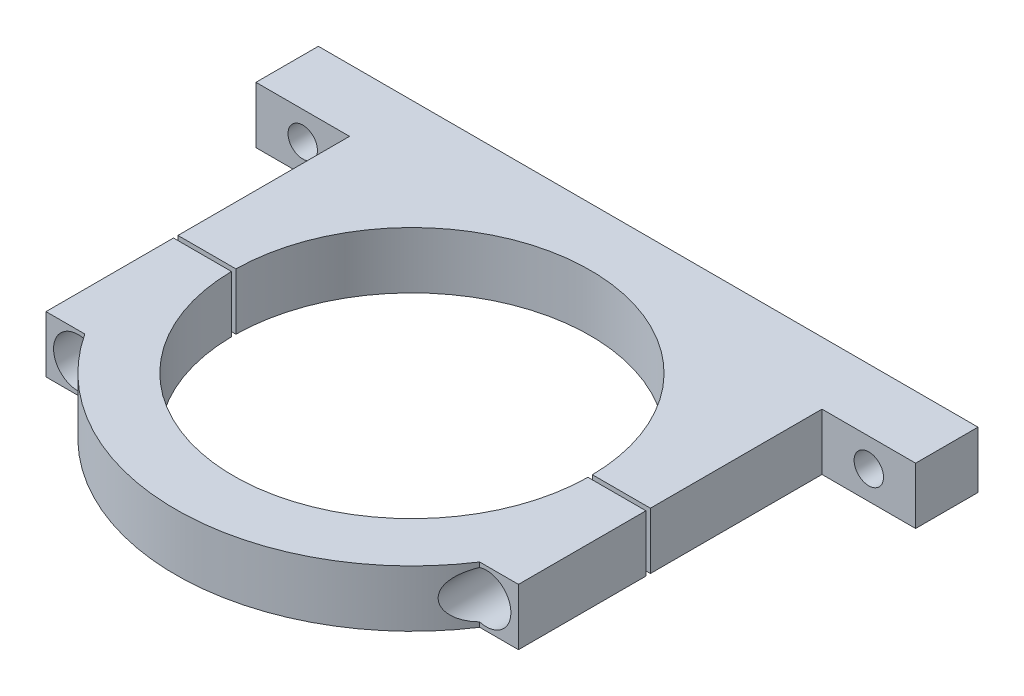
ISO-10303-21;
HEADER;
FILE_DESCRIPTION(('STEP AP214'),'2;1');
FILE_NAME('part.step','',(''),(''),'','','');
FILE_SCHEMA(('AUTOMOTIVE_DESIGN { 1 0 10303 214 1 1 1 1 }'));
ENDSEC;
DATA;
#1=APPLICATION_CONTEXT('core data for automotive mechanical design processes');
#2=APPLICATION_PROTOCOL_DEFINITION('international standard','automotive_design',2000,#1);
#3=PRODUCT_CONTEXT('',#1,'mechanical');
#4=PRODUCT('Part','Part','',(#3));
#5=PRODUCT_RELATED_PRODUCT_CATEGORY('part','',(#4));
#6=PRODUCT_DEFINITION_FORMATION('','',#4);
#7=PRODUCT_DEFINITION_CONTEXT('part definition',#1,'design');
#8=PRODUCT_DEFINITION('design','',#6,#7);
#9=PRODUCT_DEFINITION_SHAPE('','',#8);
#10=(LENGTH_UNIT() NAMED_UNIT(*) SI_UNIT(.MILLI.,.METRE.));
#11=(NAMED_UNIT(*) PLANE_ANGLE_UNIT() SI_UNIT($,.RADIAN.));
#12=(NAMED_UNIT(*) SI_UNIT($,.STERADIAN.) SOLID_ANGLE_UNIT());
#13=UNCERTAINTY_MEASURE_WITH_UNIT(LENGTH_MEASURE(1.E-05),#10,'distance_accuracy_value','');
#14=(GEOMETRIC_REPRESENTATION_CONTEXT(3) GLOBAL_UNCERTAINTY_ASSIGNED_CONTEXT((#13)) GLOBAL_UNIT_ASSIGNED_CONTEXT((#10,
#11,#12)) REPRESENTATION_CONTEXT('',''));
#15=CARTESIAN_POINT('',(0.,0.,0.));
#16=DIRECTION('',(0.,0.,1.));
#17=DIRECTION('',(1.,0.,0.));
#18=AXIS2_PLACEMENT_3D('',#15,#16,#17);
#19=CARTESIAN_POINT('',(0.,12.7,0.));
#20=DIRECTION('',(0.,1.,0.));
#21=DIRECTION('',(0.,0.,1.));
#22=AXIS2_PLACEMENT_3D('',#19,#20,#21);
#23=PLANE('',#22);
#24=DIRECTION('',(-1.,0.,0.));
#25=VECTOR('',#24,1.);
#26=CARTESIAN_POINT('',(0.,12.7,-0.499999999999999));
#27=LINE('',#26,#25);
#28=CARTESIAN_POINT('',(53.,12.7,-0.500000000000006));
#29=VERTEX_POINT('',#28);
#30=CARTESIAN_POINT('',(39.9968748779201,12.7,-0.500000000000004));
#31=VERTEX_POINT('',#30);
#32=EDGE_CURVE('E82',#29,#31,#27,.T.);
#33=ORIENTED_EDGE('',*,*,#32,.F.);
#34=DIRECTION('',(0.,0.,-1.));
#35=VECTOR('',#34,1.);
#36=CARTESIAN_POINT('',(53.,12.7,0.));
#37=LINE('',#36,#35);
#38=CARTESIAN_POINT('',(53.,12.7,-39.));
#39=VERTEX_POINT('',#38);
#40=EDGE_CURVE('E156',#29,#39,#37,.T.);
#41=ORIENTED_EDGE('',*,*,#40,.T.);
#42=DIRECTION('',(1.,0.,0.));
#43=VECTOR('',#42,1.);
#44=CARTESIAN_POINT('',(74.,12.7,-39.));
#45=LINE('',#44,#43);
#46=CARTESIAN_POINT('',(74.,12.7,-39.));
#47=VERTEX_POINT('',#46);
#48=EDGE_CURVE('E158',#39,#47,#45,.T.);
#49=ORIENTED_EDGE('',*,*,#48,.T.);
#50=DIRECTION('',(0.,0.,-1.));
#51=VECTOR('',#50,1.);
#52=CARTESIAN_POINT('',(74.,12.7,-53.));
#53=LINE('',#52,#51);
#54=CARTESIAN_POINT('',(74.,12.7,-53.));
#55=VERTEX_POINT('',#54);
#56=EDGE_CURVE('E187',#47,#55,#53,.T.);
#57=ORIENTED_EDGE('',*,*,#56,.T.);
#58=DIRECTION('',(-1.,0.,0.));
#59=VECTOR('',#58,1.);
#60=CARTESIAN_POINT('',(-74.,12.7,-53.));
#61=LINE('',#60,#59);
#62=CARTESIAN_POINT('',(-74.,12.7,-53.));
#63=VERTEX_POINT('',#62);
#64=EDGE_CURVE('E189',#55,#63,#61,.T.);
#65=ORIENTED_EDGE('',*,*,#64,.T.);
#66=DIRECTION('',(0.,0.,1.));
#67=VECTOR('',#66,1.);
#68=CARTESIAN_POINT('',(-74.,12.7,-53.));
#69=LINE('',#68,#67);
#70=CARTESIAN_POINT('',(-74.,12.7,-39.));
#71=VERTEX_POINT('',#70);
#72=EDGE_CURVE('E191',#63,#71,#69,.T.);
#73=ORIENTED_EDGE('',*,*,#72,.T.);
#74=DIRECTION('',(1.,0.,0.));
#75=VECTOR('',#74,1.);
#76=CARTESIAN_POINT('',(-74.,12.7,-39.));
#77=LINE('',#76,#75);
#78=CARTESIAN_POINT('',(-53.,12.7,-39.));
#79=VERTEX_POINT('',#78);
#80=EDGE_CURVE('E161',#71,#79,#77,.T.);
#81=ORIENTED_EDGE('',*,*,#80,.T.);
#82=DIRECTION('',(0.,0.,1.));
#83=VECTOR('',#82,1.);
#84=CARTESIAN_POINT('',(-53.,12.7,-39.));
#85=LINE('',#84,#83);
#86=CARTESIAN_POINT('',(-53.,12.7,-0.499999999999993));
#87=VERTEX_POINT('',#86);
#88=EDGE_CURVE('E141',#79,#87,#85,.T.);
#89=ORIENTED_EDGE('',*,*,#88,.T.);
#90=CARTESIAN_POINT('',(-39.9968748779201,12.7,-0.499999999999995));
#91=VERTEX_POINT('',#90);
#92=EDGE_CURVE('E129',#91,#87,#27,.T.);
#93=ORIENTED_EDGE('',*,*,#92,.F.);
#94=CARTESIAN_POINT('',(0.,12.7,0.));
#95=DIRECTION('',(0.,1.,0.));
#96=DIRECTION('',(0.,0.,1.));
#97=AXIS2_PLACEMENT_3D('',#94,#95,#96);
#98=CIRCLE('',#97,40.);
#99=EDGE_CURVE('E139',#31,#91,#98,.T.);
#100=ORIENTED_EDGE('',*,*,#99,.F.);
#101=EDGE_LOOP('',(#33,#41,#49,#57,#65,#73,#81,#89,#93,#100));
#102=FACE_BOUND('',#101,.T.);
#103=ADVANCED_FACE('F44',(#102),#23,.T.);
#104=CARTESIAN_POINT('',(0.,0.,0.));
#105=DIRECTION('',(0.,1.,0.));
#106=DIRECTION('',(0.,0.,1.));
#107=AXIS2_PLACEMENT_3D('',#104,#105,#106);
#108=PLANE('',#107);
#109=DIRECTION('',(0.,0.,-1.));
#110=VECTOR('',#109,1.);
#111=CARTESIAN_POINT('',(53.,0.,-39.));
#112=LINE('',#111,#110);
#113=CARTESIAN_POINT('',(53.,0.,-0.500000000000006));
#114=VERTEX_POINT('',#113);
#115=CARTESIAN_POINT('',(53.,0.,-39.));
#116=VERTEX_POINT('',#115);
#117=EDGE_CURVE('E151',#114,#116,#112,.T.);
#118=ORIENTED_EDGE('',*,*,#117,.F.);
#119=DIRECTION('',(-1.,0.,0.));
#120=VECTOR('',#119,1.);
#121=CARTESIAN_POINT('',(76.8528802581366,0.,-0.500000000000009));
#122=LINE('',#121,#120);
#123=CARTESIAN_POINT('',(39.9968748779201,0.,-0.500000000000004));
#124=VERTEX_POINT('',#123);
#125=EDGE_CURVE('E160',#114,#124,#122,.T.);
#126=ORIENTED_EDGE('',*,*,#125,.T.);
#127=CARTESIAN_POINT('',(0.,0.,0.));
#128=DIRECTION('',(0.,1.,0.));
#129=DIRECTION('',(0.,0.,1.));
#130=AXIS2_PLACEMENT_3D('',#127,#128,#129);
#131=CIRCLE('',#130,40.);
#132=CARTESIAN_POINT('',(-39.9968748779201,0.,-0.499999999999995));
#133=VERTEX_POINT('',#132);
#134=EDGE_CURVE('E48',#124,#133,#131,.T.);
#135=ORIENTED_EDGE('',*,*,#134,.T.);
#136=CARTESIAN_POINT('',(-53.,0.,-0.499999999999993));
#137=VERTEX_POINT('',#136);
#138=EDGE_CURVE('E124',#133,#137,#122,.T.);
#139=ORIENTED_EDGE('',*,*,#138,.T.);
#140=DIRECTION('',(0.,0.,1.));
#141=VECTOR('',#140,1.);
#142=CARTESIAN_POINT('',(-53.,0.,29.1));
#143=LINE('',#142,#141);
#144=CARTESIAN_POINT('',(-53.,0.,-39.));
#145=VERTEX_POINT('',#144);
#146=EDGE_CURVE('E153',#145,#137,#143,.T.);
#147=ORIENTED_EDGE('',*,*,#146,.F.);
#148=DIRECTION('',(1.,0.,0.));
#149=VECTOR('',#148,1.);
#150=CARTESIAN_POINT('',(-74.,0.,-39.));
#151=LINE('',#150,#149);
#152=CARTESIAN_POINT('',(-74.,0.,-39.));
#153=VERTEX_POINT('',#152);
#154=EDGE_CURVE('E201',#153,#145,#151,.T.);
#155=ORIENTED_EDGE('',*,*,#154,.F.);
#156=DIRECTION('',(0.,0.,1.));
#157=VECTOR('',#156,1.);
#158=CARTESIAN_POINT('',(-74.,0.,-53.));
#159=LINE('',#158,#157);
#160=CARTESIAN_POINT('',(-74.,0.,-53.));
#161=VERTEX_POINT('',#160);
#162=EDGE_CURVE('E198',#161,#153,#159,.T.);
#163=ORIENTED_EDGE('',*,*,#162,.F.);
#164=DIRECTION('',(-1.,0.,0.));
#165=VECTOR('',#164,1.);
#166=CARTESIAN_POINT('',(-74.,0.,-53.));
#167=LINE('',#166,#165);
#168=CARTESIAN_POINT('',(74.,0.,-53.));
#169=VERTEX_POINT('',#168);
#170=EDGE_CURVE('E182',#169,#161,#167,.T.);
#171=ORIENTED_EDGE('',*,*,#170,.F.);
#172=DIRECTION('',(0.,0.,-1.));
#173=VECTOR('',#172,1.);
#174=CARTESIAN_POINT('',(74.,0.,-53.));
#175=LINE('',#174,#173);
#176=CARTESIAN_POINT('',(74.,0.,-39.));
#177=VERTEX_POINT('',#176);
#178=EDGE_CURVE('E194',#177,#169,#175,.T.);
#179=ORIENTED_EDGE('',*,*,#178,.F.);
#180=DIRECTION('',(1.,0.,0.));
#181=VECTOR('',#180,1.);
#182=CARTESIAN_POINT('',(74.,0.,-39.));
#183=LINE('',#182,#181);
#184=EDGE_CURVE('E144',#116,#177,#183,.T.);
#185=ORIENTED_EDGE('',*,*,#184,.F.);
#186=EDGE_LOOP('',(#118,#126,#135,#139,#147,#155,#163,#171,#179,#185));
#187=FACE_BOUND('',#186,.T.);
#188=ADVANCED_FACE('F234',(#187),#108,.F.);
#189=CARTESIAN_POINT('',(53.,12.7,-39.));
#190=DIRECTION('',(-1.,0.,0.));
#191=DIRECTION('',(0.,0.,1.));
#192=AXIS2_PLACEMENT_3D('',#189,#190,#191);
#193=PLANE('',#192);
#194=ORIENTED_EDGE('',*,*,#40,.F.);
#195=DIRECTION('',(0.,-1.,0.));
#196=VECTOR('',#195,1.);
#197=CARTESIAN_POINT('',(53.,12.7,-0.500000000000007));
#198=LINE('',#197,#196);
#199=EDGE_CURVE('E122',#29,#114,#198,.T.);
#200=ORIENTED_EDGE('',*,*,#199,.T.);
#201=ORIENTED_EDGE('',*,*,#117,.T.);
#202=DIRECTION('',(0.,-1.,0.));
#203=VECTOR('',#202,1.);
#204=CARTESIAN_POINT('',(53.,12.7,-39.));
#205=LINE('',#204,#203);
#206=EDGE_CURVE('E146',#39,#116,#205,.T.);
#207=ORIENTED_EDGE('',*,*,#206,.F.);
#208=EDGE_LOOP('',(#194,#200,#201,#207));
#209=FACE_BOUND('',#208,.T.);
#210=ADVANCED_FACE('F238',(#209),#193,.F.);
#211=CARTESIAN_POINT('',(-53.,12.7,29.1));
#212=DIRECTION('',(1.,0.,0.));
#213=DIRECTION('',(0.,0.,-1.));
#214=AXIS2_PLACEMENT_3D('',#211,#212,#213);
#215=PLANE('',#214);
#216=ORIENTED_EDGE('',*,*,#146,.T.);
#217=DIRECTION('',(0.,1.,0.));
#218=VECTOR('',#217,1.);
#219=CARTESIAN_POINT('',(-53.,12.7,-0.49999999999999));
#220=LINE('',#219,#218);
#221=EDGE_CURVE('E63',#137,#87,#220,.T.);
#222=ORIENTED_EDGE('',*,*,#221,.T.);
#223=ORIENTED_EDGE('',*,*,#88,.F.);
#224=DIRECTION('',(0.,-1.,0.));
#225=VECTOR('',#224,1.);
#226=CARTESIAN_POINT('',(-53.,12.7,-39.));
#227=LINE('',#226,#225);
#228=EDGE_CURVE('E145',#79,#145,#227,.T.);
#229=ORIENTED_EDGE('',*,*,#228,.T.);
#230=EDGE_LOOP('',(#216,#222,#223,#229));
#231=FACE_BOUND('',#230,.T.);
#232=ADVANCED_FACE('F242',(#231),#215,.F.);
#233=CARTESIAN_POINT('',(0.,12.7,0.));
#234=DIRECTION('',(0.,-1.,0.));
#235=DIRECTION('',(0.,0.,-1.));
#236=AXIS2_PLACEMENT_3D('',#233,#234,#235);
#237=CYLINDRICAL_SURFACE('',#236,40.);
#238=DIRECTION('',(0.,-1.,0.));
#239=VECTOR('',#238,1.);
#240=CARTESIAN_POINT('',(39.9968748779201,12.7,-0.500000000000004));
#241=LINE('',#240,#239);
#242=EDGE_CURVE('E75',#31,#124,#241,.T.);
#243=ORIENTED_EDGE('',*,*,#242,.F.);
#244=ORIENTED_EDGE('',*,*,#99,.T.);
#245=DIRECTION('',(0.,-1.,0.));
#246=VECTOR('',#245,1.);
#247=CARTESIAN_POINT('',(-39.9968748779201,12.7,-0.499999999999995));
#248=LINE('',#247,#246);
#249=EDGE_CURVE('E126',#133,#91,#248,.F.);
#250=ORIENTED_EDGE('',*,*,#249,.F.);
#251=ORIENTED_EDGE('',*,*,#134,.F.);
#252=EDGE_LOOP('',(#243,#244,#250,#251));
#253=FACE_BOUND('',#252,.T.);
#254=ADVANCED_FACE('F143',(#253),#237,.F.);
#255=CARTESIAN_POINT('',(74.,12.7,-39.));
#256=DIRECTION('',(0.,0.,-1.));
#257=DIRECTION('',(-1.,0.,0.));
#258=AXIS2_PLACEMENT_3D('',#255,#256,#257);
#259=PLANE('',#258);
#260=CARTESIAN_POINT('',(63.5,6.35,-39.));
#261=DIRECTION('',(0.,0.,1.));
#262=DIRECTION('',(1.,0.,0.));
#263=AXIS2_PLACEMENT_3D('',#260,#261,#262);
#264=CIRCLE('',#263,3.3);
#265=CARTESIAN_POINT('',(66.8,6.35,-39.));
#266=VERTEX_POINT('',#265);
#267=EDGE_CURVE('E178',#266,#266,#264,.T.);
#268=ORIENTED_EDGE('',*,*,#267,.F.);
#269=EDGE_LOOP('',(#268));
#270=FACE_BOUND('',#269,.T.);
#271=ORIENTED_EDGE('',*,*,#184,.T.);
#272=DIRECTION('',(0.,-1.,0.));
#273=VECTOR('',#272,1.);
#274=CARTESIAN_POINT('',(74.,12.7,-39.));
#275=LINE('',#274,#273);
#276=EDGE_CURVE('E174',#47,#177,#275,.T.);
#277=ORIENTED_EDGE('',*,*,#276,.F.);
#278=ORIENTED_EDGE('',*,*,#48,.F.);
#279=ORIENTED_EDGE('',*,*,#206,.T.);
#280=EDGE_LOOP('',(#271,#277,#278,#279));
#281=FACE_BOUND('',#280,.T.);
#282=ADVANCED_FACE('F248',(#270,#281),#259,.F.);
#283=CARTESIAN_POINT('',(74.,12.7,-53.));
#284=DIRECTION('',(-1.,0.,0.));
#285=DIRECTION('',(0.,0.,1.));
#286=AXIS2_PLACEMENT_3D('',#283,#284,#285);
#287=PLANE('',#286);
#288=ORIENTED_EDGE('',*,*,#178,.T.);
#289=DIRECTION('',(0.,-1.,0.));
#290=VECTOR('',#289,1.);
#291=CARTESIAN_POINT('',(74.,12.7,-53.));
#292=LINE('',#291,#290);
#293=EDGE_CURVE('E197',#55,#169,#292,.T.);
#294=ORIENTED_EDGE('',*,*,#293,.F.);
#295=ORIENTED_EDGE('',*,*,#56,.F.);
#296=ORIENTED_EDGE('',*,*,#276,.T.);
#297=EDGE_LOOP('',(#288,#294,#295,#296));
#298=FACE_BOUND('',#297,.T.);
#299=ADVANCED_FACE('F340',(#298),#287,.F.);
#300=CARTESIAN_POINT('',(-74.,12.7,-53.));
#301=DIRECTION('',(0.,0.,1.));
#302=DIRECTION('',(1.,0.,0.));
#303=AXIS2_PLACEMENT_3D('',#300,#301,#302);
#304=PLANE('',#303);
#305=CARTESIAN_POINT('',(-63.5,6.35,-53.));
#306=DIRECTION('',(0.,0.,1.));
#307=DIRECTION('',(1.,0.,0.));
#308=AXIS2_PLACEMENT_3D('',#305,#306,#307);
#309=CIRCLE('',#308,3.3);
#310=CARTESIAN_POINT('',(-60.2,6.35,-53.));
#311=VERTEX_POINT('',#310);
#312=EDGE_CURVE('E170',#311,#311,#309,.T.);
#313=ORIENTED_EDGE('',*,*,#312,.T.);
#314=EDGE_LOOP('',(#313));
#315=FACE_BOUND('',#314,.T.);
#316=CARTESIAN_POINT('',(63.5,6.35,-53.));
#317=DIRECTION('',(0.,0.,1.));
#318=DIRECTION('',(1.,0.,0.));
#319=AXIS2_PLACEMENT_3D('',#316,#317,#318);
#320=CIRCLE('',#319,3.3);
#321=CARTESIAN_POINT('',(66.8,6.35,-53.));
#322=VERTEX_POINT('',#321);
#323=EDGE_CURVE('E173',#322,#322,#320,.T.);
#324=ORIENTED_EDGE('',*,*,#323,.T.);
#325=EDGE_LOOP('',(#324));
#326=FACE_BOUND('',#325,.T.);
#327=ORIENTED_EDGE('',*,*,#170,.T.);
#328=DIRECTION('',(0.,-1.,0.));
#329=VECTOR('',#328,1.);
#330=CARTESIAN_POINT('',(-74.,12.7,-53.));
#331=LINE('',#330,#329);
#332=EDGE_CURVE('E200',#63,#161,#331,.T.);
#333=ORIENTED_EDGE('',*,*,#332,.F.);
#334=ORIENTED_EDGE('',*,*,#64,.F.);
#335=ORIENTED_EDGE('',*,*,#293,.T.);
#336=EDGE_LOOP('',(#327,#333,#334,#335));
#337=FACE_BOUND('',#336,.T.);
#338=ADVANCED_FACE('F332',(#315,#326,#337),#304,.F.);
#339=CARTESIAN_POINT('',(-74.,12.7,-53.));
#340=DIRECTION('',(1.,0.,0.));
#341=DIRECTION('',(0.,0.,-1.));
#342=AXIS2_PLACEMENT_3D('',#339,#340,#341);
#343=PLANE('',#342);
#344=ORIENTED_EDGE('',*,*,#162,.T.);
#345=DIRECTION('',(0.,-1.,0.));
#346=VECTOR('',#345,1.);
#347=CARTESIAN_POINT('',(-74.,12.7,-39.));
#348=LINE('',#347,#346);
#349=EDGE_CURVE('E179',#71,#153,#348,.T.);
#350=ORIENTED_EDGE('',*,*,#349,.F.);
#351=ORIENTED_EDGE('',*,*,#72,.F.);
#352=ORIENTED_EDGE('',*,*,#332,.T.);
#353=EDGE_LOOP('',(#344,#350,#351,#352));
#354=FACE_BOUND('',#353,.T.);
#355=ADVANCED_FACE('F324',(#354),#343,.F.);
#356=CARTESIAN_POINT('',(-74.,12.7,-39.));
#357=DIRECTION('',(0.,0.,-1.));
#358=DIRECTION('',(-1.,0.,0.));
#359=AXIS2_PLACEMENT_3D('',#356,#357,#358);
#360=PLANE('',#359);
#361=CARTESIAN_POINT('',(-63.5,6.35,-39.));
#362=DIRECTION('',(0.,0.,1.));
#363=DIRECTION('',(1.,0.,0.));
#364=AXIS2_PLACEMENT_3D('',#361,#362,#363);
#365=CIRCLE('',#364,3.3);
#366=CARTESIAN_POINT('',(-60.2,6.35,-39.));
#367=VERTEX_POINT('',#366);
#368=EDGE_CURVE('E175',#367,#367,#365,.T.);
#369=ORIENTED_EDGE('',*,*,#368,.F.);
#370=EDGE_LOOP('',(#369));
#371=FACE_BOUND('',#370,.T.);
#372=ORIENTED_EDGE('',*,*,#154,.T.);
#373=ORIENTED_EDGE('',*,*,#228,.F.);
#374=ORIENTED_EDGE('',*,*,#80,.F.);
#375=ORIENTED_EDGE('',*,*,#349,.T.);
#376=EDGE_LOOP('',(#372,#373,#374,#375));
#377=FACE_BOUND('',#376,.T.);
#378=ADVANCED_FACE('F266',(#371,#377),#360,.F.);
#379=CARTESIAN_POINT('',(-63.5,6.35,-53.));
#380=DIRECTION('',(0.,0.,1.));
#381=DIRECTION('',(1.,0.,0.));
#382=AXIS2_PLACEMENT_3D('',#379,#380,#381);
#383=CYLINDRICAL_SURFACE('',#382,3.3);
#384=ORIENTED_EDGE('',*,*,#312,.F.);
#385=EDGE_LOOP('',(#384));
#386=FACE_BOUND('',#385,.T.);
#387=ORIENTED_EDGE('',*,*,#368,.T.);
#388=EDGE_LOOP('',(#387));
#389=FACE_BOUND('',#388,.T.);
#390=ADVANCED_FACE('F260',(#386,#389),#383,.F.);
#391=CARTESIAN_POINT('',(63.5,6.35,-53.));
#392=DIRECTION('',(0.,0.,1.));
#393=DIRECTION('',(1.,0.,0.));
#394=AXIS2_PLACEMENT_3D('',#391,#392,#393);
#395=CYLINDRICAL_SURFACE('',#394,3.3);
#396=ORIENTED_EDGE('',*,*,#323,.F.);
#397=EDGE_LOOP('',(#396));
#398=FACE_BOUND('',#397,.T.);
#399=ORIENTED_EDGE('',*,*,#267,.T.);
#400=EDGE_LOOP('',(#399));
#401=FACE_BOUND('',#400,.T.);
#402=ADVANCED_FACE('F256',(#398,#401),#395,.F.);
#403=CARTESIAN_POINT('',(76.8528802581366,0.,-0.500000000000009));
#404=DIRECTION('',(0.,0.,-1.));
#405=DIRECTION('',(-1.,0.,0.));
#406=AXIS2_PLACEMENT_3D('',#403,#404,#405);
#407=PLANE('',#406);
#408=CARTESIAN_POINT('',(45.8,6.35,-0.500000000000014));
#409=DIRECTION('',(0.,0.,-1.));
#410=DIRECTION('',(-1.,0.,0.));
#411=AXIS2_PLACEMENT_3D('',#408,#409,#410);
#412=CIRCLE('',#411,3.3);
#413=CARTESIAN_POINT('',(42.5,6.35,-0.500000000000014));
#414=VERTEX_POINT('',#413);
#415=EDGE_CURVE('E185',#414,#414,#412,.T.);
#416=ORIENTED_EDGE('',*,*,#415,.T.);
#417=EDGE_LOOP('',(#416));
#418=FACE_BOUND('',#417,.T.);
#419=ORIENTED_EDGE('',*,*,#32,.T.);
#420=ORIENTED_EDGE('',*,*,#242,.T.);
#421=ORIENTED_EDGE('',*,*,#125,.F.);
#422=ORIENTED_EDGE('',*,*,#199,.F.);
#423=EDGE_LOOP('',(#419,#420,#421,#422));
#424=FACE_BOUND('',#423,.T.);
#425=ADVANCED_FACE('F217',(#418,#424),#407,.F.);
#426=CARTESIAN_POINT('',(-45.8,6.35,-0.5));
#427=DIRECTION('',(0.,0.,-1.));
#428=DIRECTION('',(-1.,0.,0.));
#429=AXIS2_PLACEMENT_3D('',#426,#427,#428);
#430=CIRCLE('',#429,3.3);
#431=CARTESIAN_POINT('',(-49.1,6.35,-0.5));
#432=VERTEX_POINT('',#431);
#433=EDGE_CURVE('E134',#432,#432,#430,.T.);
#434=ORIENTED_EDGE('',*,*,#433,.T.);
#435=EDGE_LOOP('',(#434));
#436=FACE_BOUND('',#435,.T.);
#437=ORIENTED_EDGE('',*,*,#138,.F.);
#438=ORIENTED_EDGE('',*,*,#249,.T.);
#439=ORIENTED_EDGE('',*,*,#92,.T.);
#440=ORIENTED_EDGE('',*,*,#221,.F.);
#441=EDGE_LOOP('',(#437,#438,#439,#440));
#442=FACE_BOUND('',#441,.T.);
#443=ADVANCED_FACE('F128',(#436,#442),#407,.F.);
#444=CARTESIAN_POINT('',(45.8,6.35,-12.7));
#445=DIRECTION('',(0.,0.,1.));
#446=DIRECTION('',(1.,0.,0.));
#447=AXIS2_PLACEMENT_3D('',#444,#445,#446);
#448=PLANE('',#447);
#449=CARTESIAN_POINT('',(45.8,6.35,-12.7));
#450=DIRECTION('',(0.,0.,1.));
#451=DIRECTION('',(1.,0.,0.));
#452=AXIS2_PLACEMENT_3D('',#449,#450,#451);
#453=CIRCLE('',#452,3.3);
#454=CARTESIAN_POINT('',(49.1,6.35,-12.7));
#455=VERTEX_POINT('',#454);
#456=EDGE_CURVE('E54',#455,#455,#453,.T.);
#457=ORIENTED_EDGE('',*,*,#456,.T.);
#458=EDGE_LOOP('',(#457));
#459=FACE_BOUND('',#458,.T.);
#460=ADVANCED_FACE('F222',(#459),#448,.T.);
#461=CARTESIAN_POINT('',(45.8,6.35,72.7));
#462=DIRECTION('',(0.,0.,-1.));
#463=DIRECTION('',(-1.,0.,0.));
#464=AXIS2_PLACEMENT_3D('',#461,#462,#463);
#465=CYLINDRICAL_SURFACE('',#464,3.3);
#466=ORIENTED_EDGE('',*,*,#415,.F.);
#467=EDGE_LOOP('',(#466));
#468=FACE_BOUND('',#467,.T.);
#469=ORIENTED_EDGE('',*,*,#456,.F.);
#470=EDGE_LOOP('',(#469));
#471=FACE_BOUND('',#470,.T.);
#472=ADVANCED_FACE('F46',(#468,#471),#465,.F.);
#473=CARTESIAN_POINT('',(-45.8,6.35,-12.7));
#474=DIRECTION('',(0.,0.,1.));
#475=DIRECTION('',(1.,0.,0.));
#476=AXIS2_PLACEMENT_3D('',#473,#474,#475);
#477=PLANE('',#476);
#478=CARTESIAN_POINT('',(-45.8,6.35,-12.7));
#479=DIRECTION('',(0.,0.,1.));
#480=DIRECTION('',(1.,0.,0.));
#481=AXIS2_PLACEMENT_3D('',#478,#479,#480);
#482=CIRCLE('',#481,3.3);
#483=CARTESIAN_POINT('',(-42.5,6.35,-12.7));
#484=VERTEX_POINT('',#483);
#485=EDGE_CURVE('E12',#484,#484,#482,.T.);
#486=ORIENTED_EDGE('',*,*,#485,.T.);
#487=EDGE_LOOP('',(#486));
#488=FACE_BOUND('',#487,.T.);
#489=ADVANCED_FACE('F221',(#488),#477,.T.);
#490=CARTESIAN_POINT('',(-45.8,6.35,72.7));
#491=DIRECTION('',(0.,0.,-1.));
#492=DIRECTION('',(-1.,0.,0.));
#493=AXIS2_PLACEMENT_3D('',#490,#491,#492);
#494=CYLINDRICAL_SURFACE('',#493,3.3);
#495=ORIENTED_EDGE('',*,*,#433,.F.);
#496=EDGE_LOOP('',(#495));
#497=FACE_BOUND('',#496,.T.);
#498=ORIENTED_EDGE('',*,*,#485,.F.);
#499=EDGE_LOOP('',(#498));
#500=FACE_BOUND('',#499,.T.);
#501=ADVANCED_FACE('F252',(#497,#500),#494,.F.);
#502=CLOSED_SHELL('',(#103,#188,#210,#232,#254,#282,#299,#338,#355,#378,#390,#402,#425,#443,
#460,#472,#489,#501));
#503=MANIFOLD_SOLID_BREP('B2',#502);
#504=CARTESIAN_POINT('',(-45.8,6.35,72.7));
#505=DIRECTION('',(0.,0.,-1.));
#506=DIRECTION('',(-1.,0.,0.));
#507=AXIS2_PLACEMENT_3D('',#504,#505,#506);
#508=CYLINDRICAL_SURFACE('',#507,3.3);
#509=CARTESIAN_POINT('',(-45.8,6.35,0.5));
#510=DIRECTION('',(0.,0.,1.));
#511=DIRECTION('',(1.,0.,0.));
#512=AXIS2_PLACEMENT_3D('',#509,#510,#511);
#513=CIRCLE('',#512,3.3);
#514=CARTESIAN_POINT('',(-42.5,6.35,0.5));
#515=VERTEX_POINT('',#514);
#516=EDGE_CURVE('E541',#515,#515,#513,.T.);
#517=ORIENTED_EDGE('',*,*,#516,.F.);
#518=EDGE_LOOP('',(#517));
#519=FACE_BOUND('',#518,.T.);
#520=CARTESIAN_POINT('',(-45.8,6.35,21.3));
#521=DIRECTION('',(0.,0.,1.));
#522=DIRECTION('',(1.,0.,0.));
#523=AXIS2_PLACEMENT_3D('',#520,#521,#522);
#524=CIRCLE('',#523,3.3);
#525=CARTESIAN_POINT('',(-42.5,6.35,21.3));
#526=VERTEX_POINT('',#525);
#527=EDGE_CURVE('E433',#526,#526,#524,.T.);
#528=ORIENTED_EDGE('',*,*,#527,.T.);
#529=EDGE_LOOP('',(#528));
#530=FACE_BOUND('',#529,.T.);
#531=ADVANCED_FACE('F428',(#519,#530),#508,.F.);
#532=CARTESIAN_POINT('',(45.8,6.35,72.7));
#533=DIRECTION('',(0.,0.,-1.));
#534=DIRECTION('',(-1.,0.,0.));
#535=AXIS2_PLACEMENT_3D('',#532,#533,#534);
#536=CYLINDRICAL_SURFACE('',#535,3.3);
#537=CARTESIAN_POINT('',(45.8,6.35,0.499999999999987));
#538=DIRECTION('',(0.,0.,1.));
#539=DIRECTION('',(1.,0.,0.));
#540=AXIS2_PLACEMENT_3D('',#537,#538,#539);
#541=CIRCLE('',#540,3.3);
#542=CARTESIAN_POINT('',(49.1,6.35,0.499999999999986));
#543=VERTEX_POINT('',#542);
#544=EDGE_CURVE('E538',#543,#543,#541,.T.);
#545=ORIENTED_EDGE('',*,*,#544,.F.);
#546=EDGE_LOOP('',(#545));
#547=FACE_BOUND('',#546,.T.);
#548=CARTESIAN_POINT('',(45.8,6.35,21.3));
#549=DIRECTION('',(0.,0.,1.));
#550=DIRECTION('',(1.,0.,0.));
#551=AXIS2_PLACEMENT_3D('',#548,#549,#550);
#552=CIRCLE('',#551,3.3);
#553=CARTESIAN_POINT('',(49.1,6.35,21.3));
#554=VERTEX_POINT('',#553);
#555=EDGE_CURVE('E517',#554,#554,#552,.T.);
#556=ORIENTED_EDGE('',*,*,#555,.T.);
#557=EDGE_LOOP('',(#556));
#558=FACE_BOUND('',#557,.T.);
#559=ADVANCED_FACE('F568',(#547,#558),#536,.F.);
#560=CARTESIAN_POINT('',(-44.2966138660733,12.7,29.1));
#561=DIRECTION('',(0.,0.,-1.));
#562=DIRECTION('',(-1.,0.,0.));
#563=AXIS2_PLACEMENT_3D('',#560,#561,#562);
#564=PLANE('',#563);
#565=DIRECTION('',(0.,-1.,0.));
#566=VECTOR('',#565,1.);
#567=CARTESIAN_POINT('',(-44.2966138660733,12.7,29.1));
#568=LINE('',#567,#566);
#569=CARTESIAN_POINT('',(-44.2966138660733,1.05945842731418,29.1));
#570=VERTEX_POINT('',#569);
#571=CARTESIAN_POINT('',(-44.2966138660733,0.,29.1));
#572=VERTEX_POINT('',#571);
#573=EDGE_CURVE('E516',#570,#572,#568,.T.);
#574=ORIENTED_EDGE('',*,*,#573,.F.);
#575=CARTESIAN_POINT('',(-45.8,6.35,29.1));
#576=DIRECTION('',(0.,0.,-1.));
#577=DIRECTION('',(-1.,0.,0.));
#578=AXIS2_PLACEMENT_3D('',#575,#576,#577);
#579=CIRCLE('',#578,5.5);
#580=CARTESIAN_POINT('',(-44.2966138660733,11.6405415726858,29.1));
#581=VERTEX_POINT('',#580);
#582=EDGE_CURVE('E444',#570,#581,#579,.T.);
#583=ORIENTED_EDGE('',*,*,#582,.T.);
#584=CARTESIAN_POINT('',(-44.2966138660733,12.7,29.1));
#585=VERTEX_POINT('',#584);
#586=EDGE_CURVE('E513',#585,#581,#568,.T.);
#587=ORIENTED_EDGE('',*,*,#586,.F.);
#588=DIRECTION('',(1.,0.,0.));
#589=VECTOR('',#588,1.);
#590=CARTESIAN_POINT('',(-44.2966138660733,12.7,29.1));
#591=LINE('',#590,#589);
#592=CARTESIAN_POINT('',(-53.,12.7,29.1));
#593=VERTEX_POINT('',#592);
#594=EDGE_CURVE('E528',#593,#585,#591,.T.);
#595=ORIENTED_EDGE('',*,*,#594,.F.);
#596=DIRECTION('',(0.,-1.,0.));
#597=VECTOR('',#596,1.);
#598=CARTESIAN_POINT('',(-53.,12.7,29.1));
#599=LINE('',#598,#597);
#600=CARTESIAN_POINT('',(-53.,0.,29.1));
#601=VERTEX_POINT('',#600);
#602=EDGE_CURVE('E523',#593,#601,#599,.T.);
#603=ORIENTED_EDGE('',*,*,#602,.T.);
#604=DIRECTION('',(1.,0.,0.));
#605=VECTOR('',#604,1.);
#606=CARTESIAN_POINT('',(-44.2966138660733,0.,29.1));
#607=LINE('',#606,#605);
#608=EDGE_CURVE('E530',#601,#572,#607,.T.);
#609=ORIENTED_EDGE('',*,*,#608,.T.);
#610=EDGE_LOOP('',(#574,#583,#587,#595,#603,#609));
#611=FACE_BOUND('',#610,.T.);
#612=ADVANCED_FACE('F511',(#611),#564,.F.);
#613=CARTESIAN_POINT('',(53.,12.7,29.1));
#614=DIRECTION('',(0.,0.,-1.));
#615=DIRECTION('',(-1.,0.,0.));
#616=AXIS2_PLACEMENT_3D('',#613,#614,#615);
#617=PLANE('',#616);
#618=DIRECTION('',(0.,-1.,0.));
#619=VECTOR('',#618,1.);
#620=CARTESIAN_POINT('',(44.2966138660733,12.7,29.1));
#621=LINE('',#620,#619);
#622=CARTESIAN_POINT('',(44.2966138660733,12.7,29.1));
#623=VERTEX_POINT('',#622);
#624=CARTESIAN_POINT('',(44.2966138660733,11.6405415726858,29.1));
#625=VERTEX_POINT('',#624);
#626=EDGE_CURVE('E507',#623,#625,#621,.T.);
#627=ORIENTED_EDGE('',*,*,#626,.T.);
#628=CARTESIAN_POINT('',(45.8,6.35,29.1));
#629=DIRECTION('',(0.,0.,-1.));
#630=DIRECTION('',(-1.,0.,0.));
#631=AXIS2_PLACEMENT_3D('',#628,#629,#630);
#632=CIRCLE('',#631,5.5);
#633=CARTESIAN_POINT('',(44.2966138660733,1.05945842731418,29.1));
#634=VERTEX_POINT('',#633);
#635=EDGE_CURVE('E451',#625,#634,#632,.T.);
#636=ORIENTED_EDGE('',*,*,#635,.T.);
#637=CARTESIAN_POINT('',(44.2966138660733,0.,29.1));
#638=VERTEX_POINT('',#637);
#639=EDGE_CURVE('E535',#634,#638,#621,.T.);
#640=ORIENTED_EDGE('',*,*,#639,.T.);
#641=DIRECTION('',(1.,0.,0.));
#642=VECTOR('',#641,1.);
#643=CARTESIAN_POINT('',(53.,0.,29.1));
#644=LINE('',#643,#642);
#645=CARTESIAN_POINT('',(53.,0.,29.1));
#646=VERTEX_POINT('',#645);
#647=EDGE_CURVE('E655',#638,#646,#644,.T.);
#648=ORIENTED_EDGE('',*,*,#647,.T.);
#649=DIRECTION('',(0.,-1.,0.));
#650=VECTOR('',#649,1.);
#651=CARTESIAN_POINT('',(53.,12.7,29.1));
#652=LINE('',#651,#650);
#653=CARTESIAN_POINT('',(53.,12.7,29.1));
#654=VERTEX_POINT('',#653);
#655=EDGE_CURVE('E526',#654,#646,#652,.T.);
#656=ORIENTED_EDGE('',*,*,#655,.F.);
#657=DIRECTION('',(1.,0.,0.));
#658=VECTOR('',#657,1.);
#659=CARTESIAN_POINT('',(53.,12.7,29.1));
#660=LINE('',#659,#658);
#661=EDGE_CURVE('E602',#623,#654,#660,.T.);
#662=ORIENTED_EDGE('',*,*,#661,.F.);
#663=EDGE_LOOP('',(#627,#636,#640,#648,#656,#662));
#664=FACE_BOUND('',#663,.T.);
#665=ADVANCED_FACE('F591',(#664),#617,.F.);
#666=CARTESIAN_POINT('',(53.,12.7,-39.));
#667=DIRECTION('',(-1.,0.,0.));
#668=DIRECTION('',(0.,0.,1.));
#669=AXIS2_PLACEMENT_3D('',#666,#667,#668);
#670=PLANE('',#669);
#671=DIRECTION('',(0.,0.,-1.));
#672=VECTOR('',#671,1.);
#673=CARTESIAN_POINT('',(53.,0.,-39.));
#674=LINE('',#673,#672);
#675=CARTESIAN_POINT('',(53.,0.,0.499999999999994));
#676=VERTEX_POINT('',#675);
#677=EDGE_CURVE('E658',#646,#676,#674,.T.);
#678=ORIENTED_EDGE('',*,*,#677,.T.);
#679=DIRECTION('',(0.,1.,0.));
#680=VECTOR('',#679,1.);
#681=CARTESIAN_POINT('',(53.,12.7,0.499999999999994));
#682=LINE('',#681,#680);
#683=CARTESIAN_POINT('',(53.,12.7,0.499999999999994));
#684=VERTEX_POINT('',#683);
#685=EDGE_CURVE('E630',#676,#684,#682,.T.);
#686=ORIENTED_EDGE('',*,*,#685,.T.);
#687=DIRECTION('',(0.,0.,-1.));
#688=VECTOR('',#687,1.);
#689=CARTESIAN_POINT('',(53.,12.7,0.));
#690=LINE('',#689,#688);
#691=EDGE_CURVE('E648',#654,#684,#690,.T.);
#692=ORIENTED_EDGE('',*,*,#691,.F.);
#693=ORIENTED_EDGE('',*,*,#655,.T.);
#694=EDGE_LOOP('',(#678,#686,#692,#693));
#695=FACE_BOUND('',#694,.T.);
#696=ADVANCED_FACE('F579',(#695),#670,.F.);
#697=CARTESIAN_POINT('',(0.,12.7,0.));
#698=DIRECTION('',(0.,-1.,0.));
#699=DIRECTION('',(0.,0.,-1.));
#700=AXIS2_PLACEMENT_3D('',#697,#698,#699);
#701=CYLINDRICAL_SURFACE('',#700,40.);
#702=DIRECTION('',(0.,-1.,0.));
#703=VECTOR('',#702,1.);
#704=CARTESIAN_POINT('',(-39.9968748779201,12.7,0.500000000000005));
#705=LINE('',#704,#703);
#706=CARTESIAN_POINT('',(-39.9968748779201,12.7,0.500000000000005));
#707=VERTEX_POINT('',#706);
#708=CARTESIAN_POINT('',(-39.9968748779201,0.,0.500000000000005));
#709=VERTEX_POINT('',#708);
#710=EDGE_CURVE('E634',#707,#709,#705,.T.);
#711=ORIENTED_EDGE('',*,*,#710,.F.);
#712=CARTESIAN_POINT('',(0.,12.7,0.));
#713=DIRECTION('',(0.,1.,0.));
#714=DIRECTION('',(0.,0.,1.));
#715=AXIS2_PLACEMENT_3D('',#712,#713,#714);
#716=CIRCLE('',#715,40.);
#717=CARTESIAN_POINT('',(39.9968748779201,12.7,0.499999999999996));
#718=VERTEX_POINT('',#717);
#719=EDGE_CURVE('E640',#707,#718,#716,.T.);
#720=ORIENTED_EDGE('',*,*,#719,.T.);
#721=DIRECTION('',(0.,-1.,0.));
#722=VECTOR('',#721,1.);
#723=CARTESIAN_POINT('',(39.9968748779201,12.7,0.499999999999996));
#724=LINE('',#723,#722);
#725=CARTESIAN_POINT('',(39.9968748779201,0.,0.499999999999996));
#726=VERTEX_POINT('',#725);
#727=EDGE_CURVE('E626',#726,#718,#724,.F.);
#728=ORIENTED_EDGE('',*,*,#727,.F.);
#729=CARTESIAN_POINT('',(0.,0.,0.));
#730=DIRECTION('',(0.,1.,0.));
#731=DIRECTION('',(0.,0.,1.));
#732=AXIS2_PLACEMENT_3D('',#729,#730,#731);
#733=CIRCLE('',#732,40.);
#734=EDGE_CURVE('E639',#709,#726,#733,.T.);
#735=ORIENTED_EDGE('',*,*,#734,.F.);
#736=EDGE_LOOP('',(#711,#720,#728,#735));
#737=FACE_BOUND('',#736,.T.);
#738=ADVANCED_FACE('F575',(#737),#701,.F.);
#739=CARTESIAN_POINT('',(-53.,12.7,29.1));
#740=DIRECTION('',(1.,0.,0.));
#741=DIRECTION('',(0.,0.,-1.));
#742=AXIS2_PLACEMENT_3D('',#739,#740,#741);
#743=PLANE('',#742);
#744=DIRECTION('',(0.,0.,1.));
#745=VECTOR('',#744,1.);
#746=CARTESIAN_POINT('',(-53.,12.7,-39.));
#747=LINE('',#746,#745);
#748=CARTESIAN_POINT('',(-53.,12.7,0.500000000000006));
#749=VERTEX_POINT('',#748);
#750=EDGE_CURVE('E651',#749,#593,#747,.T.);
#751=ORIENTED_EDGE('',*,*,#750,.F.);
#752=DIRECTION('',(0.,-1.,0.));
#753=VECTOR('',#752,1.);
#754=CARTESIAN_POINT('',(-53.,12.7,0.500000000000004));
#755=LINE('',#754,#753);
#756=CARTESIAN_POINT('',(-53.,0.,0.500000000000006));
#757=VERTEX_POINT('',#756);
#758=EDGE_CURVE('E636',#749,#757,#755,.T.);
#759=ORIENTED_EDGE('',*,*,#758,.T.);
#760=DIRECTION('',(0.,0.,1.));
#761=VECTOR('',#760,1.);
#762=CARTESIAN_POINT('',(-53.,0.,29.1));
#763=LINE('',#762,#761);
#764=EDGE_CURVE('E660',#757,#601,#763,.T.);
#765=ORIENTED_EDGE('',*,*,#764,.T.);
#766=ORIENTED_EDGE('',*,*,#602,.F.);
#767=EDGE_LOOP('',(#751,#759,#765,#766));
#768=FACE_BOUND('',#767,.T.);
#769=ADVANCED_FACE('F578',(#768),#743,.F.);
#770=CARTESIAN_POINT('',(0.,0.,0.));
#771=DIRECTION('',(0.,1.,0.));
#772=DIRECTION('',(0.,0.,1.));
#773=AXIS2_PLACEMENT_3D('',#770,#771,#772);
#774=PLANE('',#773);
#775=ORIENTED_EDGE('',*,*,#764,.F.);
#776=DIRECTION('',(1.,0.,0.));
#777=VECTOR('',#776,1.);
#778=CARTESIAN_POINT('',(76.8528802581366,0.,0.499999999999991));
#779=LINE('',#778,#777);
#780=EDGE_CURVE('E542',#757,#709,#779,.T.);
#781=ORIENTED_EDGE('',*,*,#780,.T.);
#782=ORIENTED_EDGE('',*,*,#734,.T.);
#783=EDGE_CURVE('E621',#726,#676,#779,.T.);
#784=ORIENTED_EDGE('',*,*,#783,.T.);
#785=ORIENTED_EDGE('',*,*,#677,.F.);
#786=ORIENTED_EDGE('',*,*,#647,.F.);
#787=CARTESIAN_POINT('',(0.,0.,0.));
#788=DIRECTION('',(0.,1.,0.));
#789=DIRECTION('',(0.,0.,1.));
#790=AXIS2_PLACEMENT_3D('',#787,#788,#789);
#791=CIRCLE('',#790,53.);
#792=EDGE_CURVE('E643',#572,#638,#791,.T.);
#793=ORIENTED_EDGE('',*,*,#792,.F.);
#794=ORIENTED_EDGE('',*,*,#608,.F.);
#795=EDGE_LOOP('',(#775,#781,#782,#784,#785,#786,#793,#794));
#796=FACE_BOUND('',#795,.T.);
#797=ADVANCED_FACE('F584',(#796),#774,.F.);
#798=CARTESIAN_POINT('',(0.,12.7,0.));
#799=DIRECTION('',(0.,1.,0.));
#800=DIRECTION('',(0.,0.,1.));
#801=AXIS2_PLACEMENT_3D('',#798,#799,#800);
#802=PLANE('',#801);
#803=DIRECTION('',(1.,0.,0.));
#804=VECTOR('',#803,1.);
#805=CARTESIAN_POINT('',(0.,12.7,0.5));
#806=LINE('',#805,#804);
#807=EDGE_CURVE('E631',#749,#707,#806,.T.);
#808=ORIENTED_EDGE('',*,*,#807,.F.);
#809=ORIENTED_EDGE('',*,*,#750,.T.);
#810=ORIENTED_EDGE('',*,*,#594,.T.);
#811=CARTESIAN_POINT('',(0.,12.7,0.));
#812=DIRECTION('',(0.,1.,0.));
#813=DIRECTION('',(0.,0.,1.));
#814=AXIS2_PLACEMENT_3D('',#811,#812,#813);
#815=CIRCLE('',#814,53.);
#816=EDGE_CURVE('E522',#585,#623,#815,.T.);
#817=ORIENTED_EDGE('',*,*,#816,.T.);
#818=ORIENTED_EDGE('',*,*,#661,.T.);
#819=ORIENTED_EDGE('',*,*,#691,.T.);
#820=EDGE_CURVE('E628',#718,#684,#806,.T.);
#821=ORIENTED_EDGE('',*,*,#820,.F.);
#822=ORIENTED_EDGE('',*,*,#719,.F.);
#823=EDGE_LOOP('',(#808,#809,#810,#817,#818,#819,#821,#822));
#824=FACE_BOUND('',#823,.T.);
#825=ADVANCED_FACE('F581',(#824),#802,.T.);
#826=CARTESIAN_POINT('',(0.,12.7,0.));
#827=DIRECTION('',(0.,-1.,0.));
#828=DIRECTION('',(0.,0.,-1.));
#829=AXIS2_PLACEMENT_3D('',#826,#827,#828);
#830=CYLINDRICAL_SURFACE('',#829,53.);
#831=ORIENTED_EDGE('',*,*,#639,.F.);
#832=CARTESIAN_POINT('',(44.2966138660733,1.05945842731418,29.1));
#833=CARTESIAN_POINT('',(44.2023815242243,1.08624432417976,29.2434460519519));
#834=CARTESIAN_POINT('',(44.1076838854779,1.11586737616969,29.3860747025699));
#835=CARTESIAN_POINT('',(43.9175392275361,1.18120177596019,29.6694931625543));
#836=CARTESIAN_POINT('',(43.8220919701592,1.21691514026491,29.8102823461965));
#837=CARTESIAN_POINT('',(43.6301378068745,1.29505254305774,30.0905315715594));
#838=CARTESIAN_POINT('',(43.5336279654728,1.3375142511577,30.2299791920461));
#839=CARTESIAN_POINT('',(43.3404001928338,1.42945045478321,30.5063627421269));
#840=CARTESIAN_POINT('',(43.2436822825022,1.47892427546232,30.6432989119927));
#841=CARTESIAN_POINT('',(42.950595371388,1.64030263754939,31.0541545261707));
#842=CARTESIAN_POINT('',(42.7543377321346,1.7639669459111,31.3236814200426));
#843=CARTESIAN_POINT('',(42.3664979428006,2.04668942417624,31.8462745427233));
#844=CARTESIAN_POINT('',(42.1749046664452,2.20565179494719,32.0993829733258));
#845=CARTESIAN_POINT('',(41.9098228617666,2.46047591189412,32.4435435490439));
#846=CARTESIAN_POINT('',(41.8320630377454,2.53972054288799,32.5437236902504));
#847=CARTESIAN_POINT('',(41.6789860574376,2.70582620685729,32.7395412328894));
#848=CARTESIAN_POINT('',(41.6036689990633,2.79268754461458,32.8351784523008));
#849=CARTESIAN_POINT('',(41.3827737729154,3.06478051731731,33.1137716355579));
#850=CARTESIAN_POINT('',(41.241781840281,3.26196092295997,33.2890167210241));
#851=CARTESIAN_POINT('',(40.9774889576154,3.69330887930783,33.6138346287925));
#852=CARTESIAN_POINT('',(40.8544656696495,3.9279590208514,33.763010365223));
#853=CARTESIAN_POINT('',(40.6927162450865,4.30443822924972,33.9574741968097));
#854=CARTESIAN_POINT('',(40.6426131819704,4.43395736921869,34.0173936685986));
#855=CARTESIAN_POINT('',(40.5512884488154,4.7004968466023,34.1262071903266));
#856=CARTESIAN_POINT('',(40.5100620137625,4.83751310973597,34.1751071562465));
#857=CARTESIAN_POINT('',(40.4242933651929,5.17048082877192,34.2765590084944));
#858=CARTESIAN_POINT('',(40.3842615751446,5.36933415710017,34.32365599987));
#859=CARTESIAN_POINT('',(40.3263648986972,5.77453466332056,34.3916608824789));
#860=CARTESIAN_POINT('',(40.3084853693875,5.98087679806151,34.4125860736736));
#861=CARTESIAN_POINT('',(40.2962722440065,6.39563452076774,34.4268869788116));
#862=CARTESIAN_POINT('',(40.3019832655902,6.60405329333085,34.420210488685));
#863=CARTESIAN_POINT('',(40.3365820651297,7.01624557635018,34.3796571084739));
#864=CARTESIAN_POINT('',(40.3654753607812,7.22001796902887,34.3457737427825));
#865=CARTESIAN_POINT('',(40.4434536613123,7.61371113221727,34.2539128051144));
#866=CARTESIAN_POINT('',(40.4921491139715,7.80382021509107,34.1963998652543));
#867=CARTESIAN_POINT('',(40.606589866845,8.17085794739567,34.0604278937041));
#868=CARTESIAN_POINT('',(40.6723424272613,8.34778094290862,33.9819599422852));
#869=CARTESIAN_POINT('',(40.8510414625942,8.76458618691264,33.7671395555785));
#870=CARTESIAN_POINT('',(40.9717801319317,8.995964557463,33.620768126539));
#871=CARTESIAN_POINT('',(41.233197512216,9.42536012102401,33.2996446825846));
#872=CARTESIAN_POINT('',(41.3739164561452,9.62330819242972,33.1248352978904));
#873=CARTESIAN_POINT('',(41.6297935921758,9.94018132692004,32.8023043577606));
#874=CARTESIAN_POINT('',(41.7421474540749,10.0663022348739,32.6592733257022));
#875=CARTESIAN_POINT('',(41.9716309093297,10.3023031345705,32.3638249709236));
#876=CARTESIAN_POINT('',(42.0887629975649,10.4121744997199,32.2114027229634));
#877=CARTESIAN_POINT('',(42.3264029872547,10.6171808448913,31.8985009767725));
#878=CARTESIAN_POINT('',(42.4469209279755,10.7122649571823,31.7379960755882));
#879=CARTESIAN_POINT('',(42.689605907684,10.8884942607699,31.4108107093532));
#880=CARTESIAN_POINT('',(42.8117726081638,10.9696422677157,31.2441315000517));
#881=CARTESIAN_POINT('',(43.0488090994757,11.1143422066645,30.9166333767665));
#882=CARTESIAN_POINT('',(43.1636382976267,11.1786939929398,30.7561354372072));
#883=CARTESIAN_POINT('',(43.3932374733321,11.2971383506349,30.4313408694239));
#884=CARTESIAN_POINT('',(43.508007441668,11.3512296361315,30.2670437679512));
#885=CARTESIAN_POINT('',(43.735692801556,11.4493967822089,29.9370821151644));
#886=CARTESIAN_POINT('',(43.8486146727796,11.4935767046975,29.7714527330725));
#887=CARTESIAN_POINT('',(44.0734482248692,11.5733311627101,29.4375909655432));
#888=CARTESIAN_POINT('',(44.1853604302009,11.6089104470098,29.2693600713597));
#889=CARTESIAN_POINT('',(44.2966138660733,11.6405415726858,29.1));
#890=B_SPLINE_CURVE_WITH_KNOTS('',3,(#832,#833,#834,#835,#836,#837,#838,#839,#840,#841,#842,
#843,#844,#845,#846,#847,#848,#849,#850,#851,#852,#853,#854,#855,#856,#857,#858,#859,#860,#861,
#862,#863,#864,#865,#866,#867,#868,#869,#870,#871,#872,#873,#874,#875,#876,#877,#878,#879,#880,
#881,#882,#883,#884,#885,#886,#887,#888,#889),.UNSPECIFIED.,.F.,.F.,(4,2,2,2,2,2,2,2,2,2,2,2,2,
2,2,2,2,2,2,2,2,2,2,2,2,2,2,2,4),(0.,0.521115090409919,1.04240305837072,1.5667102825855,
2.09096708163957,3.15596513316458,4.21810735426249,4.6664855243085,5.1148816443623,
6.00903886886817,6.91581149317633,7.3688276919024,7.82160009983574,8.44344487589338,
9.06487838540379,9.68748777203192,10.3102453921162,10.9213028945153,11.5326209159272,
12.425318034929,13.3198389076253,13.9829626751566,14.6464372292899,15.3121459056596,
15.9777199236794,16.6001297176027,17.2226174651497,17.8382269952476,18.4534958409367),.UNSPECIFIED.);
#891=EDGE_CURVE('E42',#634,#625,#890,.T.);
#892=ORIENTED_EDGE('',*,*,#891,.T.);
#893=ORIENTED_EDGE('',*,*,#626,.F.);
#894=ORIENTED_EDGE('',*,*,#816,.F.);
#895=ORIENTED_EDGE('',*,*,#586,.T.);
#896=CARTESIAN_POINT('',(-44.2966138660733,11.6405415726858,29.1));
#897=CARTESIAN_POINT('',(-44.2023815242243,11.6137556758202,29.2434460519519));
#898=CARTESIAN_POINT('',(-44.1076838854779,11.5841326238303,29.3860747025699));
#899=CARTESIAN_POINT('',(-43.9175392275361,11.5187982240398,29.6694931625543));
#900=CARTESIAN_POINT('',(-43.8220919701592,11.4830848597351,29.8102823461965));
#901=CARTESIAN_POINT('',(-43.6301378068745,11.4049474569423,30.0905315715594));
#902=CARTESIAN_POINT('',(-43.5336279654728,11.3624857488423,30.2299791920461));
#903=CARTESIAN_POINT('',(-43.3404001928338,11.2705495452168,30.5063627421269));
#904=CARTESIAN_POINT('',(-43.2436822825022,11.2210757245377,30.6432989119927));
#905=CARTESIAN_POINT('',(-42.9505953713879,11.0596973624506,31.0541545261707));
#906=CARTESIAN_POINT('',(-42.7543377321345,10.9360330540889,31.3236814200426));
#907=CARTESIAN_POINT('',(-42.3664979428005,10.6533105758237,31.8462745427233));
#908=CARTESIAN_POINT('',(-42.1749046664452,10.4943482050528,32.0993829733258));
#909=CARTESIAN_POINT('',(-41.9098228617666,10.2395240881059,32.4435435490439));
#910=CARTESIAN_POINT('',(-41.8320630377454,10.160279457112,32.5437236902504));
#911=CARTESIAN_POINT('',(-41.6789860574376,9.9941737931427,32.7395412328893));
#912=CARTESIAN_POINT('',(-41.6036689990633,9.90731245538542,32.8351784523008));
#913=CARTESIAN_POINT('',(-41.3827737729154,9.63521948268269,33.1137716355579));
#914=CARTESIAN_POINT('',(-41.241781840281,9.43803907704002,33.2890167210241));
#915=CARTESIAN_POINT('',(-40.9774889576154,9.00669112069217,33.6138346287925));
#916=CARTESIAN_POINT('',(-40.8544656696495,8.77204097914859,33.763010365223));
#917=CARTESIAN_POINT('',(-40.6927162450865,8.39556177075028,33.9574741968097));
#918=CARTESIAN_POINT('',(-40.6426131819704,8.26604263078131,34.0173936685986));
#919=CARTESIAN_POINT('',(-40.5512884488154,7.9995031533977,34.1262071903266));
#920=CARTESIAN_POINT('',(-40.5100620137625,7.86248689026403,34.1751071562464));
#921=CARTESIAN_POINT('',(-40.4242933651929,7.52951917122808,34.2765590084944));
#922=CARTESIAN_POINT('',(-40.3842615751446,7.33066584289983,34.32365599987));
#923=CARTESIAN_POINT('',(-40.3263648986972,6.92546533667943,34.3916608824789));
#924=CARTESIAN_POINT('',(-40.3084853693875,6.71912320193849,34.4125860736736));
#925=CARTESIAN_POINT('',(-40.2962722440065,6.30436547923226,34.4268869788116));
#926=CARTESIAN_POINT('',(-40.3019832655902,6.09594670666915,34.420210488685));
#927=CARTESIAN_POINT('',(-40.3365820651297,5.68375442364982,34.3796571084739));
#928=CARTESIAN_POINT('',(-40.3654753607812,5.47998203097113,34.3457737427825));
#929=CARTESIAN_POINT('',(-40.4434536613123,5.08628886778273,34.2539128051144));
#930=CARTESIAN_POINT('',(-40.4921491139715,4.89617978490893,34.1963998652543));
#931=CARTESIAN_POINT('',(-40.606589866845,4.52914205260433,34.0604278937041));
#932=CARTESIAN_POINT('',(-40.6723424272613,4.35221905709138,33.9819599422852));
#933=CARTESIAN_POINT('',(-40.8510414625943,3.93541381308736,33.7671395555785));
#934=CARTESIAN_POINT('',(-40.9717801319317,3.70403544253699,33.620768126539));
#935=CARTESIAN_POINT('',(-41.233197512216,3.27463987897598,33.2996446825846));
#936=CARTESIAN_POINT('',(-41.3739164561452,3.07669180757028,33.1248352978904));
#937=CARTESIAN_POINT('',(-41.6297935921758,2.75981867307996,32.8023043577605));
#938=CARTESIAN_POINT('',(-41.7421474540749,2.63369776512615,32.6592733257021));
#939=CARTESIAN_POINT('',(-41.9716309093297,2.39769686542948,32.3638249709236));
#940=CARTESIAN_POINT('',(-42.0887629975649,2.28782550028013,32.2114027229634));
#941=CARTESIAN_POINT('',(-42.3264029872547,2.08281915510873,31.8985009767725));
#942=CARTESIAN_POINT('',(-42.4469209279755,1.98773504281774,31.7379960755882));
#943=CARTESIAN_POINT('',(-42.689605907684,1.81150573923014,31.4108107093532));
#944=CARTESIAN_POINT('',(-42.8117726081638,1.73035773228426,31.2441315000517));
#945=CARTESIAN_POINT('',(-43.0488090994757,1.58565779333552,30.9166333767665));
#946=CARTESIAN_POINT('',(-43.1636382976267,1.52130600706024,30.7561354372072));
#947=CARTESIAN_POINT('',(-43.3932374733321,1.40286164936505,30.4313408694238));
#948=CARTESIAN_POINT('',(-43.508007441668,1.34877036386846,30.2670437679512));
#949=CARTESIAN_POINT('',(-43.735692801556,1.25060321779113,29.9370821151644));
#950=CARTESIAN_POINT('',(-43.8486146727796,1.20642329530251,29.7714527330725));
#951=CARTESIAN_POINT('',(-44.0734482248692,1.1266688372899,29.4375909655432));
#952=CARTESIAN_POINT('',(-44.1853604302009,1.09108955299023,29.2693600713597));
#953=CARTESIAN_POINT('',(-44.2966138660733,1.05945842731418,29.1));
#954=B_SPLINE_CURVE_WITH_KNOTS('',3,(#896,#897,#898,#899,#900,#901,#902,#903,#904,#905,#906,
#907,#908,#909,#910,#911,#912,#913,#914,#915,#916,#917,#918,#919,#920,#921,#922,#923,#924,#925,
#926,#927,#928,#929,#930,#931,#932,#933,#934,#935,#936,#937,#938,#939,#940,#941,#942,#943,#944,
#945,#946,#947,#948,#949,#950,#951,#952,#953),.UNSPECIFIED.,.F.,.F.,(4,2,2,2,2,2,2,2,2,2,2,2,2,
2,2,2,2,2,2,2,2,2,2,2,2,2,2,2,4),(0.,0.521115090409916,1.04240305837072,1.5667102825855,
2.09096708163957,3.15596513316458,4.21810735426248,4.66648552430849,5.11488164436228,
6.00903886886816,6.91581149317632,7.36882769190238,7.82160009983572,8.44344487589336,
9.06487838540377,9.6874877720319,10.3102453921161,10.9213028945153,11.5326209159272,
12.425318034929,13.3198389076252,13.9829626751566,14.6464372292898,15.3121459056596,
15.9777199236794,16.6001297176026,17.2226174651497,17.8382269952475,18.4534958409367),.UNSPECIFIED.);
#955=EDGE_CURVE('E438',#581,#570,#954,.T.);
#956=ORIENTED_EDGE('',*,*,#955,.T.);
#957=ORIENTED_EDGE('',*,*,#573,.T.);
#958=ORIENTED_EDGE('',*,*,#792,.T.);
#959=EDGE_LOOP('',(#831,#892,#893,#894,#895,#956,#957,#958));
#960=FACE_BOUND('',#959,.T.);
#961=ADVANCED_FACE('F430',(#960),#830,.T.);
#962=CARTESIAN_POINT('',(76.8528802581366,0.,0.499999999999991));
#963=DIRECTION('',(0.,0.,1.));
#964=DIRECTION('',(1.,0.,0.));
#965=AXIS2_PLACEMENT_3D('',#962,#963,#964);
#966=PLANE('',#965);
#967=ORIENTED_EDGE('',*,*,#544,.T.);
#968=EDGE_LOOP('',(#967));
#969=FACE_BOUND('',#968,.T.);
#970=ORIENTED_EDGE('',*,*,#783,.F.);
#971=ORIENTED_EDGE('',*,*,#727,.T.);
#972=ORIENTED_EDGE('',*,*,#820,.T.);
#973=ORIENTED_EDGE('',*,*,#685,.F.);
#974=EDGE_LOOP('',(#970,#971,#972,#973));
#975=FACE_BOUND('',#974,.T.);
#976=ADVANCED_FACE('F566',(#969,#975),#966,.F.);
#977=ORIENTED_EDGE('',*,*,#516,.T.);
#978=EDGE_LOOP('',(#977));
#979=FACE_BOUND('',#978,.T.);
#980=ORIENTED_EDGE('',*,*,#807,.T.);
#981=ORIENTED_EDGE('',*,*,#710,.T.);
#982=ORIENTED_EDGE('',*,*,#780,.F.);
#983=ORIENTED_EDGE('',*,*,#758,.F.);
#984=EDGE_LOOP('',(#980,#981,#982,#983));
#985=FACE_BOUND('',#984,.T.);
#986=ADVANCED_FACE('F562',(#979,#985),#966,.F.);
#987=CARTESIAN_POINT('',(45.8,6.35,21.3));
#988=DIRECTION('',(0.,0.,1.));
#989=DIRECTION('',(1.,0.,0.));
#990=AXIS2_PLACEMENT_3D('',#987,#988,#989);
#991=CYLINDRICAL_SURFACE('',#990,5.5);
#992=CARTESIAN_POINT('',(45.8,6.35,21.3));
#993=DIRECTION('',(0.,0.,1.));
#994=DIRECTION('',(1.,0.,0.));
#995=AXIS2_PLACEMENT_3D('',#992,#993,#994);
#996=CIRCLE('',#995,5.5);
#997=CARTESIAN_POINT('',(51.3,6.35,21.3));
#998=VERTEX_POINT('',#997);
#999=EDGE_CURVE('E544',#998,#998,#996,.T.);
#1000=ORIENTED_EDGE('',*,*,#999,.F.);
#1001=EDGE_LOOP('',(#1000));
#1002=FACE_BOUND('',#1001,.T.);
#1003=ORIENTED_EDGE('',*,*,#891,.F.);
#1004=ORIENTED_EDGE('',*,*,#635,.F.);
#1005=EDGE_LOOP('',(#1003,#1004));
#1006=FACE_BOUND('',#1005,.T.);
#1007=ADVANCED_FACE('F565',(#1002,#1006),#991,.F.);
#1008=CARTESIAN_POINT('',(45.8,6.35,21.3));
#1009=DIRECTION('',(0.,0.,1.));
#1010=DIRECTION('',(1.,0.,0.));
#1011=AXIS2_PLACEMENT_3D('',#1008,#1009,#1010);
#1012=PLANE('',#1011);
#1013=ORIENTED_EDGE('',*,*,#555,.F.);
#1014=EDGE_LOOP('',(#1013));
#1015=FACE_BOUND('',#1014,.T.);
#1016=ORIENTED_EDGE('',*,*,#999,.T.);
#1017=EDGE_LOOP('',(#1016));
#1018=FACE_BOUND('',#1017,.T.);
#1019=ADVANCED_FACE('F560',(#1015,#1018),#1012,.T.);
#1020=CARTESIAN_POINT('',(-45.8,6.35,21.3));
#1021=DIRECTION('',(0.,0.,1.));
#1022=DIRECTION('',(1.,0.,0.));
#1023=AXIS2_PLACEMENT_3D('',#1020,#1021,#1022);
#1024=CYLINDRICAL_SURFACE('',#1023,5.5);
#1025=CARTESIAN_POINT('',(-45.8,6.35,21.3));
#1026=DIRECTION('',(0.,0.,1.));
#1027=DIRECTION('',(1.,0.,0.));
#1028=AXIS2_PLACEMENT_3D('',#1025,#1026,#1027);
#1029=CIRCLE('',#1028,5.5);
#1030=CARTESIAN_POINT('',(-40.3,6.35,21.3));
#1031=VERTEX_POINT('',#1030);
#1032=EDGE_CURVE('E615',#1031,#1031,#1029,.T.);
#1033=ORIENTED_EDGE('',*,*,#1032,.F.);
#1034=EDGE_LOOP('',(#1033));
#1035=FACE_BOUND('',#1034,.T.);
#1036=ORIENTED_EDGE('',*,*,#955,.F.);
#1037=ORIENTED_EDGE('',*,*,#582,.F.);
#1038=EDGE_LOOP('',(#1036,#1037));
#1039=FACE_BOUND('',#1038,.T.);
#1040=ADVANCED_FACE('F503',(#1035,#1039),#1024,.F.);
#1041=CARTESIAN_POINT('',(-45.8,6.35,21.3));
#1042=DIRECTION('',(0.,0.,1.));
#1043=DIRECTION('',(1.,0.,0.));
#1044=AXIS2_PLACEMENT_3D('',#1041,#1042,#1043);
#1045=PLANE('',#1044);
#1046=ORIENTED_EDGE('',*,*,#527,.F.);
#1047=EDGE_LOOP('',(#1046));
#1048=FACE_BOUND('',#1047,.T.);
#1049=ORIENTED_EDGE('',*,*,#1032,.T.);
#1050=EDGE_LOOP('',(#1049));
#1051=FACE_BOUND('',#1050,.T.);
#1052=ADVANCED_FACE('F559',(#1048,#1051),#1045,.T.);
#1053=CLOSED_SHELL('',(#531,#559,#612,#665,#696,#738,#769,#797,#825,#961,#976,#986,#1007,#1019,
#1040,#1052));
#1054=MANIFOLD_SOLID_BREP('B6',#1053);
#1055=ADVANCED_BREP_SHAPE_REPRESENTATION('',(#18,#503,#1054),#14);
#1056=SHAPE_DEFINITION_REPRESENTATION(#9,#1055);
ENDSEC;
END-ISO-10303-21;
